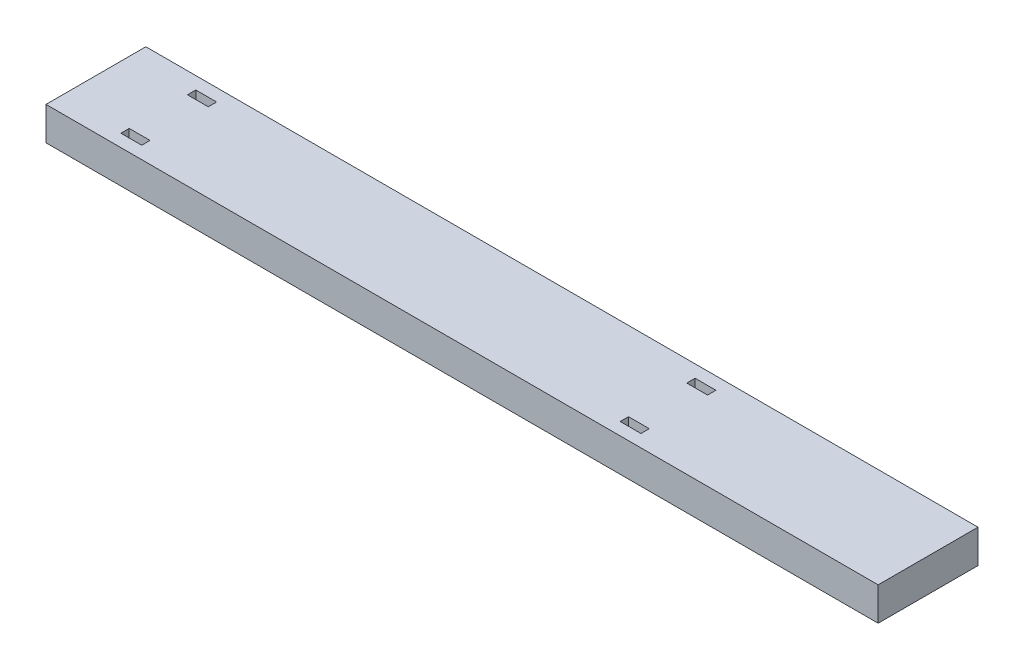
ISO-10303-21;
HEADER;
FILE_DESCRIPTION(('STEP AP214'),'2;1');
FILE_NAME('part.step','',(''),(''),'','','');
FILE_SCHEMA(('AUTOMOTIVE_DESIGN { 1 0 10303 214 1 1 1 1 }'));
ENDSEC;
DATA;
#1=APPLICATION_CONTEXT('core data for automotive mechanical design processes');
#2=APPLICATION_PROTOCOL_DEFINITION('international standard','automotive_design',2000,#1);
#3=PRODUCT_CONTEXT('',#1,'mechanical');
#4=PRODUCT('Part','Part','',(#3));
#5=PRODUCT_RELATED_PRODUCT_CATEGORY('part','',(#4));
#6=PRODUCT_DEFINITION_FORMATION('','',#4);
#7=PRODUCT_DEFINITION_CONTEXT('part definition',#1,'design');
#8=PRODUCT_DEFINITION('design','',#6,#7);
#9=PRODUCT_DEFINITION_SHAPE('','',#8);
#10=(LENGTH_UNIT() NAMED_UNIT(*) SI_UNIT(.MILLI.,.METRE.));
#11=(NAMED_UNIT(*) PLANE_ANGLE_UNIT() SI_UNIT($,.RADIAN.));
#12=(NAMED_UNIT(*) SI_UNIT($,.STERADIAN.) SOLID_ANGLE_UNIT());
#13=UNCERTAINTY_MEASURE_WITH_UNIT(LENGTH_MEASURE(1.E-05),#10,'distance_accuracy_value','');
#14=(GEOMETRIC_REPRESENTATION_CONTEXT(3) GLOBAL_UNCERTAINTY_ASSIGNED_CONTEXT((#13)) GLOBAL_UNIT_ASSIGNED_CONTEXT((#10,
#11,#12)) REPRESENTATION_CONTEXT('',''));
#15=CARTESIAN_POINT('',(0.,0.,0.));
#16=DIRECTION('',(0.,0.,1.));
#17=DIRECTION('',(1.,0.,0.));
#18=AXIS2_PLACEMENT_3D('',#15,#16,#17);
#19=CARTESIAN_POINT('',(200.,8.,0.));
#20=DIRECTION('',(0.,0.,-1.));
#21=DIRECTION('',(-1.,0.,0.));
#22=AXIS2_PLACEMENT_3D('',#19,#20,#21);
#23=PLANE('',#22);
#24=DIRECTION('',(1.,0.,0.));
#25=VECTOR('',#24,1.);
#26=CARTESIAN_POINT('',(200.,0.,0.));
#27=LINE('',#26,#25);
#28=CARTESIAN_POINT('',(0.,0.,0.));
#29=VERTEX_POINT('',#28);
#30=CARTESIAN_POINT('',(200.,0.,0.));
#31=VERTEX_POINT('',#30);
#32=EDGE_CURVE('E302',#29,#31,#27,.T.);
#33=ORIENTED_EDGE('',*,*,#32,.T.);
#34=DIRECTION('',(0.,-1.,0.));
#35=VECTOR('',#34,1.);
#36=CARTESIAN_POINT('',(200.,8.,0.));
#37=LINE('',#36,#35);
#38=CARTESIAN_POINT('',(200.,8.,0.));
#39=VERTEX_POINT('',#38);
#40=EDGE_CURVE('E11',#39,#31,#37,.T.);
#41=ORIENTED_EDGE('',*,*,#40,.F.);
#42=DIRECTION('',(1.,0.,0.));
#43=VECTOR('',#42,1.);
#44=CARTESIAN_POINT('',(200.,8.,0.));
#45=LINE('',#44,#43);
#46=CARTESIAN_POINT('',(0.,8.,0.));
#47=VERTEX_POINT('',#46);
#48=EDGE_CURVE('E309',#47,#39,#45,.T.);
#49=ORIENTED_EDGE('',*,*,#48,.F.);
#50=DIRECTION('',(0.,-1.,0.));
#51=VECTOR('',#50,1.);
#52=CARTESIAN_POINT('',(0.,8.,0.));
#53=LINE('',#52,#51);
#54=EDGE_CURVE('E319',#47,#29,#53,.T.);
#55=ORIENTED_EDGE('',*,*,#54,.T.);
#56=EDGE_LOOP('',(#33,#41,#49,#55));
#57=FACE_BOUND('',#56,.T.);
#58=ADVANCED_FACE('F37',(#57),#23,.F.);
#59=CARTESIAN_POINT('',(200.,8.,-24.));
#60=DIRECTION('',(-1.,0.,0.));
#61=DIRECTION('',(0.,0.,1.));
#62=AXIS2_PLACEMENT_3D('',#59,#60,#61);
#63=PLANE('',#62);
#64=DIRECTION('',(0.,0.,-1.));
#65=VECTOR('',#64,1.);
#66=CARTESIAN_POINT('',(200.,0.,-24.));
#67=LINE('',#66,#65);
#68=CARTESIAN_POINT('',(200.,0.,-24.));
#69=VERTEX_POINT('',#68);
#70=EDGE_CURVE('E322',#31,#69,#67,.T.);
#71=ORIENTED_EDGE('',*,*,#70,.T.);
#72=DIRECTION('',(0.,-1.,0.));
#73=VECTOR('',#72,1.);
#74=CARTESIAN_POINT('',(200.,8.,-24.));
#75=LINE('',#74,#73);
#76=CARTESIAN_POINT('',(200.,8.,-24.));
#77=VERTEX_POINT('',#76);
#78=EDGE_CURVE('E44',#77,#69,#75,.T.);
#79=ORIENTED_EDGE('',*,*,#78,.F.);
#80=DIRECTION('',(0.,0.,-1.));
#81=VECTOR('',#80,1.);
#82=CARTESIAN_POINT('',(200.,8.,-24.));
#83=LINE('',#82,#81);
#84=EDGE_CURVE('E312',#39,#77,#83,.T.);
#85=ORIENTED_EDGE('',*,*,#84,.F.);
#86=ORIENTED_EDGE('',*,*,#40,.T.);
#87=EDGE_LOOP('',(#71,#79,#85,#86));
#88=FACE_BOUND('',#87,.T.);
#89=ADVANCED_FACE('F351',(#88),#63,.F.);
#90=CARTESIAN_POINT('',(0.,8.,-24.));
#91=DIRECTION('',(0.,0.,1.));
#92=DIRECTION('',(1.,0.,0.));
#93=AXIS2_PLACEMENT_3D('',#90,#91,#92);
#94=PLANE('',#93);
#95=DIRECTION('',(-1.,0.,0.));
#96=VECTOR('',#95,1.);
#97=CARTESIAN_POINT('',(0.,0.,-24.));
#98=LINE('',#97,#96);
#99=CARTESIAN_POINT('',(0.,0.,-24.));
#100=VERTEX_POINT('',#99);
#101=EDGE_CURVE('E324',#69,#100,#98,.T.);
#102=ORIENTED_EDGE('',*,*,#101,.T.);
#103=DIRECTION('',(0.,-1.,0.));
#104=VECTOR('',#103,1.);
#105=CARTESIAN_POINT('',(0.,8.,-24.));
#106=LINE('',#105,#104);
#107=CARTESIAN_POINT('',(0.,8.,-24.));
#108=VERTEX_POINT('',#107);
#109=EDGE_CURVE('E329',#108,#100,#106,.T.);
#110=ORIENTED_EDGE('',*,*,#109,.F.);
#111=DIRECTION('',(-1.,0.,0.));
#112=VECTOR('',#111,1.);
#113=CARTESIAN_POINT('',(0.,8.,-24.));
#114=LINE('',#113,#112);
#115=EDGE_CURVE('E315',#77,#108,#114,.T.);
#116=ORIENTED_EDGE('',*,*,#115,.F.);
#117=ORIENTED_EDGE('',*,*,#78,.T.);
#118=EDGE_LOOP('',(#102,#110,#116,#117));
#119=FACE_BOUND('',#118,.T.);
#120=ADVANCED_FACE('F336',(#119),#94,.F.);
#121=CARTESIAN_POINT('',(0.,8.,0.));
#122=DIRECTION('',(1.,0.,0.));
#123=DIRECTION('',(0.,0.,-1.));
#124=AXIS2_PLACEMENT_3D('',#121,#122,#123);
#125=PLANE('',#124);
#126=DIRECTION('',(0.,0.,1.));
#127=VECTOR('',#126,1.);
#128=CARTESIAN_POINT('',(0.,0.,0.));
#129=LINE('',#128,#127);
#130=EDGE_CURVE('E313',#100,#29,#129,.T.);
#131=ORIENTED_EDGE('',*,*,#130,.T.);
#132=ORIENTED_EDGE('',*,*,#54,.F.);
#133=DIRECTION('',(0.,0.,1.));
#134=VECTOR('',#133,1.);
#135=CARTESIAN_POINT('',(0.,8.,0.));
#136=LINE('',#135,#134);
#137=EDGE_CURVE('E317',#108,#47,#136,.T.);
#138=ORIENTED_EDGE('',*,*,#137,.F.);
#139=ORIENTED_EDGE('',*,*,#109,.T.);
#140=EDGE_LOOP('',(#131,#132,#138,#139));
#141=FACE_BOUND('',#140,.T.);
#142=ADVANCED_FACE('F344',(#141),#125,.F.);
#143=CARTESIAN_POINT('',(0.,8.,0.));
#144=DIRECTION('',(0.,-1.,0.));
#145=DIRECTION('',(0.,0.,-1.));
#146=AXIS2_PLACEMENT_3D('',#143,#144,#145);
#147=PLANE('',#146);
#148=DIRECTION('',(1.,0.,0.));
#149=VECTOR('',#148,1.);
#150=CARTESIAN_POINT('',(20.,8.,-3.));
#151=LINE('',#150,#149);
#152=CARTESIAN_POINT('',(15.,8.,-3.));
#153=VERTEX_POINT('',#152);
#154=CARTESIAN_POINT('',(20.,8.,-3.));
#155=VERTEX_POINT('',#154);
#156=EDGE_CURVE('E263',#153,#155,#151,.T.);
#157=ORIENTED_EDGE('',*,*,#156,.F.);
#158=DIRECTION('',(0.,0.,1.));
#159=VECTOR('',#158,1.);
#160=CARTESIAN_POINT('',(15.,8.,-3.));
#161=LINE('',#160,#159);
#162=CARTESIAN_POINT('',(15.,8.,-5.));
#163=VERTEX_POINT('',#162);
#164=EDGE_CURVE('E51',#163,#153,#161,.T.);
#165=ORIENTED_EDGE('',*,*,#164,.F.);
#166=DIRECTION('',(-1.,0.,0.));
#167=VECTOR('',#166,1.);
#168=CARTESIAN_POINT('',(15.,8.,-5.));
#169=LINE('',#168,#167);
#170=CARTESIAN_POINT('',(20.,8.,-5.));
#171=VERTEX_POINT('',#170);
#172=EDGE_CURVE('E252',#171,#163,#169,.T.);
#173=ORIENTED_EDGE('',*,*,#172,.F.);
#174=DIRECTION('',(0.,0.,-1.));
#175=VECTOR('',#174,1.);
#176=CARTESIAN_POINT('',(20.,8.,-5.));
#177=LINE('',#176,#175);
#178=EDGE_CURVE('E266',#155,#171,#177,.T.);
#179=ORIENTED_EDGE('',*,*,#178,.F.);
#180=EDGE_LOOP('',(#157,#165,#173,#179));
#181=FACE_BOUND('',#180,.T.);
#182=DIRECTION('',(0.,0.,1.));
#183=VECTOR('',#182,1.);
#184=CARTESIAN_POINT('',(135.,8.,-2.99999999999998));
#185=LINE('',#184,#183);
#186=CARTESIAN_POINT('',(135.,8.,-4.99999999999999));
#187=VERTEX_POINT('',#186);
#188=CARTESIAN_POINT('',(135.,8.,-2.99999999999998));
#189=VERTEX_POINT('',#188);
#190=EDGE_CURVE('E233',#187,#189,#185,.T.);
#191=ORIENTED_EDGE('',*,*,#190,.F.);
#192=DIRECTION('',(-1.,0.,0.));
#193=VECTOR('',#192,1.);
#194=CARTESIAN_POINT('',(135.,8.,-4.99999999999999));
#195=LINE('',#194,#193);
#196=CARTESIAN_POINT('',(140.,8.,-4.99999999999999));
#197=VERTEX_POINT('',#196);
#198=EDGE_CURVE('E59',#197,#187,#195,.T.);
#199=ORIENTED_EDGE('',*,*,#198,.F.);
#200=DIRECTION('',(0.,0.,-1.));
#201=VECTOR('',#200,1.);
#202=CARTESIAN_POINT('',(140.,8.,-4.99999999999999));
#203=LINE('',#202,#201);
#204=CARTESIAN_POINT('',(140.,8.,-2.99999999999998));
#205=VERTEX_POINT('',#204);
#206=EDGE_CURVE('E222',#205,#197,#203,.T.);
#207=ORIENTED_EDGE('',*,*,#206,.F.);
#208=DIRECTION('',(1.,0.,0.));
#209=VECTOR('',#208,1.);
#210=CARTESIAN_POINT('',(140.,8.,-2.99999999999998));
#211=LINE('',#210,#209);
#212=EDGE_CURVE('E237',#189,#205,#211,.T.);
#213=ORIENTED_EDGE('',*,*,#212,.F.);
#214=EDGE_LOOP('',(#191,#199,#207,#213));
#215=FACE_BOUND('',#214,.T.);
#216=DIRECTION('',(0.,0.,1.));
#217=VECTOR('',#216,1.);
#218=CARTESIAN_POINT('',(135.,8.,-21.));
#219=LINE('',#218,#217);
#220=CARTESIAN_POINT('',(135.,8.,-21.));
#221=VERTEX_POINT('',#220);
#222=CARTESIAN_POINT('',(135.,8.,-19.));
#223=VERTEX_POINT('',#222);
#224=EDGE_CURVE('E207',#221,#223,#219,.T.);
#225=ORIENTED_EDGE('',*,*,#224,.F.);
#226=DIRECTION('',(-1.,0.,0.));
#227=VECTOR('',#226,1.);
#228=CARTESIAN_POINT('',(140.,8.,-21.));
#229=LINE('',#228,#227);
#230=CARTESIAN_POINT('',(140.,8.,-21.));
#231=VERTEX_POINT('',#230);
#232=EDGE_CURVE('E180',#231,#221,#229,.T.);
#233=ORIENTED_EDGE('',*,*,#232,.F.);
#234=DIRECTION('',(0.,0.,-1.));
#235=VECTOR('',#234,1.);
#236=CARTESIAN_POINT('',(140.,8.,-19.));
#237=LINE('',#236,#235);
#238=CARTESIAN_POINT('',(140.,8.,-19.));
#239=VERTEX_POINT('',#238);
#240=EDGE_CURVE('E198',#239,#231,#237,.T.);
#241=ORIENTED_EDGE('',*,*,#240,.F.);
#242=DIRECTION('',(1.,0.,0.));
#243=VECTOR('',#242,1.);
#244=CARTESIAN_POINT('',(135.,8.,-19.));
#245=LINE('',#244,#243);
#246=EDGE_CURVE('E201',#223,#239,#245,.T.);
#247=ORIENTED_EDGE('',*,*,#246,.F.);
#248=EDGE_LOOP('',(#225,#233,#241,#247));
#249=FACE_BOUND('',#248,.T.);
#250=DIRECTION('',(0.,0.,1.));
#251=VECTOR('',#250,1.);
#252=CARTESIAN_POINT('',(15.,8.,-21.));
#253=LINE('',#252,#251);
#254=CARTESIAN_POINT('',(15.,8.,-21.));
#255=VERTEX_POINT('',#254);
#256=CARTESIAN_POINT('',(15.,8.,-19.));
#257=VERTEX_POINT('',#256);
#258=EDGE_CURVE('E292',#255,#257,#253,.T.);
#259=ORIENTED_EDGE('',*,*,#258,.F.);
#260=DIRECTION('',(-1.,0.,0.));
#261=VECTOR('',#260,1.);
#262=CARTESIAN_POINT('',(20.,8.,-21.));
#263=LINE('',#262,#261);
#264=CARTESIAN_POINT('',(20.,8.,-21.));
#265=VERTEX_POINT('',#264);
#266=EDGE_CURVE('E214',#265,#255,#263,.T.);
#267=ORIENTED_EDGE('',*,*,#266,.F.);
#268=DIRECTION('',(0.,0.,-1.));
#269=VECTOR('',#268,1.);
#270=CARTESIAN_POINT('',(20.,8.,-19.));
#271=LINE('',#270,#269);
#272=CARTESIAN_POINT('',(20.,8.,-19.));
#273=VERTEX_POINT('',#272);
#274=EDGE_CURVE('E281',#273,#265,#271,.T.);
#275=ORIENTED_EDGE('',*,*,#274,.F.);
#276=DIRECTION('',(1.,0.,0.));
#277=VECTOR('',#276,1.);
#278=CARTESIAN_POINT('',(15.,8.,-19.));
#279=LINE('',#278,#277);
#280=EDGE_CURVE('E295',#257,#273,#279,.T.);
#281=ORIENTED_EDGE('',*,*,#280,.F.);
#282=EDGE_LOOP('',(#259,#267,#275,#281));
#283=FACE_BOUND('',#282,.T.);
#284=ORIENTED_EDGE('',*,*,#48,.T.);
#285=ORIENTED_EDGE('',*,*,#84,.T.);
#286=ORIENTED_EDGE('',*,*,#115,.T.);
#287=ORIENTED_EDGE('',*,*,#137,.T.);
#288=EDGE_LOOP('',(#284,#285,#286,#287));
#289=FACE_BOUND('',#288,.T.);
#290=ADVANCED_FACE('F350',(#181,#215,#249,#283,#289),#147,.F.);
#291=CARTESIAN_POINT('',(0.,0.,0.));
#292=DIRECTION('',(0.,-1.,0.));
#293=DIRECTION('',(0.,0.,-1.));
#294=AXIS2_PLACEMENT_3D('',#291,#292,#293);
#295=PLANE('',#294);
#296=DIRECTION('',(0.,0.,1.));
#297=VECTOR('',#296,1.);
#298=CARTESIAN_POINT('',(15.,0.,-3.));
#299=LINE('',#298,#297);
#300=CARTESIAN_POINT('',(15.,0.,-5.));
#301=VERTEX_POINT('',#300);
#302=CARTESIAN_POINT('',(15.,0.,-3.));
#303=VERTEX_POINT('',#302);
#304=EDGE_CURVE('E248',#301,#303,#299,.T.);
#305=ORIENTED_EDGE('',*,*,#304,.T.);
#306=DIRECTION('',(1.,0.,0.));
#307=VECTOR('',#306,1.);
#308=CARTESIAN_POINT('',(20.,0.,-3.));
#309=LINE('',#308,#307);
#310=CARTESIAN_POINT('',(20.,0.,-3.));
#311=VERTEX_POINT('',#310);
#312=EDGE_CURVE('E251',#303,#311,#309,.T.);
#313=ORIENTED_EDGE('',*,*,#312,.T.);
#314=DIRECTION('',(0.,0.,-1.));
#315=VECTOR('',#314,1.);
#316=CARTESIAN_POINT('',(20.,0.,-5.));
#317=LINE('',#316,#315);
#318=CARTESIAN_POINT('',(20.,0.,-5.));
#319=VERTEX_POINT('',#318);
#320=EDGE_CURVE('E255',#311,#319,#317,.T.);
#321=ORIENTED_EDGE('',*,*,#320,.T.);
#322=DIRECTION('',(-1.,0.,0.));
#323=VECTOR('',#322,1.);
#324=CARTESIAN_POINT('',(15.,0.,-5.));
#325=LINE('',#324,#323);
#326=EDGE_CURVE('E258',#319,#301,#325,.T.);
#327=ORIENTED_EDGE('',*,*,#326,.T.);
#328=EDGE_LOOP('',(#305,#313,#321,#327));
#329=FACE_BOUND('',#328,.T.);
#330=DIRECTION('',(-1.,0.,0.));
#331=VECTOR('',#330,1.);
#332=CARTESIAN_POINT('',(135.,0.,-4.99999999999999));
#333=LINE('',#332,#331);
#334=CARTESIAN_POINT('',(140.,0.,-4.99999999999999));
#335=VERTEX_POINT('',#334);
#336=CARTESIAN_POINT('',(135.,0.,-4.99999999999999));
#337=VERTEX_POINT('',#336);
#338=EDGE_CURVE('E218',#335,#337,#333,.T.);
#339=ORIENTED_EDGE('',*,*,#338,.T.);
#340=DIRECTION('',(0.,0.,1.));
#341=VECTOR('',#340,1.);
#342=CARTESIAN_POINT('',(135.,0.,-2.99999999999998));
#343=LINE('',#342,#341);
#344=CARTESIAN_POINT('',(135.,0.,-2.99999999999998));
#345=VERTEX_POINT('',#344);
#346=EDGE_CURVE('E221',#337,#345,#343,.T.);
#347=ORIENTED_EDGE('',*,*,#346,.T.);
#348=DIRECTION('',(1.,0.,0.));
#349=VECTOR('',#348,1.);
#350=CARTESIAN_POINT('',(140.,0.,-2.99999999999998));
#351=LINE('',#350,#349);
#352=CARTESIAN_POINT('',(140.,0.,-2.99999999999998));
#353=VERTEX_POINT('',#352);
#354=EDGE_CURVE('E225',#345,#353,#351,.T.);
#355=ORIENTED_EDGE('',*,*,#354,.T.);
#356=DIRECTION('',(0.,0.,-1.));
#357=VECTOR('',#356,1.);
#358=CARTESIAN_POINT('',(140.,0.,-4.99999999999999));
#359=LINE('',#358,#357);
#360=EDGE_CURVE('E228',#353,#335,#359,.T.);
#361=ORIENTED_EDGE('',*,*,#360,.T.);
#362=EDGE_LOOP('',(#339,#347,#355,#361));
#363=FACE_BOUND('',#362,.T.);
#364=DIRECTION('',(-1.,0.,0.));
#365=VECTOR('',#364,1.);
#366=CARTESIAN_POINT('',(140.,0.,-21.));
#367=LINE('',#366,#365);
#368=CARTESIAN_POINT('',(140.,0.,-21.));
#369=VERTEX_POINT('',#368);
#370=CARTESIAN_POINT('',(135.,0.,-21.));
#371=VERTEX_POINT('',#370);
#372=EDGE_CURVE('E177',#369,#371,#367,.T.);
#373=ORIENTED_EDGE('',*,*,#372,.T.);
#374=DIRECTION('',(0.,0.,1.));
#375=VECTOR('',#374,1.);
#376=CARTESIAN_POINT('',(135.,0.,-21.));
#377=LINE('',#376,#375);
#378=CARTESIAN_POINT('',(135.,0.,-19.));
#379=VERTEX_POINT('',#378);
#380=EDGE_CURVE('E189',#371,#379,#377,.T.);
#381=ORIENTED_EDGE('',*,*,#380,.T.);
#382=DIRECTION('',(1.,0.,0.));
#383=VECTOR('',#382,1.);
#384=CARTESIAN_POINT('',(135.,0.,-19.));
#385=LINE('',#384,#383);
#386=CARTESIAN_POINT('',(140.,0.,-19.));
#387=VERTEX_POINT('',#386);
#388=EDGE_CURVE('E193',#379,#387,#385,.T.);
#389=ORIENTED_EDGE('',*,*,#388,.T.);
#390=DIRECTION('',(0.,0.,-1.));
#391=VECTOR('',#390,1.);
#392=CARTESIAN_POINT('',(140.,0.,-19.));
#393=LINE('',#392,#391);
#394=EDGE_CURVE('E185',#387,#369,#393,.T.);
#395=ORIENTED_EDGE('',*,*,#394,.T.);
#396=EDGE_LOOP('',(#373,#381,#389,#395));
#397=FACE_BOUND('',#396,.T.);
#398=DIRECTION('',(-1.,0.,0.));
#399=VECTOR('',#398,1.);
#400=CARTESIAN_POINT('',(20.,0.,-21.));
#401=LINE('',#400,#399);
#402=CARTESIAN_POINT('',(20.,0.,-21.));
#403=VERTEX_POINT('',#402);
#404=CARTESIAN_POINT('',(15.,0.,-21.));
#405=VERTEX_POINT('',#404);
#406=EDGE_CURVE('E277',#403,#405,#401,.T.);
#407=ORIENTED_EDGE('',*,*,#406,.T.);
#408=DIRECTION('',(0.,0.,1.));
#409=VECTOR('',#408,1.);
#410=CARTESIAN_POINT('',(15.,0.,-21.));
#411=LINE('',#410,#409);
#412=CARTESIAN_POINT('',(15.,0.,-19.));
#413=VERTEX_POINT('',#412);
#414=EDGE_CURVE('E280',#405,#413,#411,.T.);
#415=ORIENTED_EDGE('',*,*,#414,.T.);
#416=DIRECTION('',(1.,0.,0.));
#417=VECTOR('',#416,1.);
#418=CARTESIAN_POINT('',(15.,0.,-19.));
#419=LINE('',#418,#417);
#420=CARTESIAN_POINT('',(20.,0.,-19.));
#421=VERTEX_POINT('',#420);
#422=EDGE_CURVE('E284',#413,#421,#419,.T.);
#423=ORIENTED_EDGE('',*,*,#422,.T.);
#424=DIRECTION('',(0.,0.,-1.));
#425=VECTOR('',#424,1.);
#426=CARTESIAN_POINT('',(20.,0.,-19.));
#427=LINE('',#426,#425);
#428=EDGE_CURVE('E287',#421,#403,#427,.T.);
#429=ORIENTED_EDGE('',*,*,#428,.T.);
#430=EDGE_LOOP('',(#407,#415,#423,#429));
#431=FACE_BOUND('',#430,.T.);
#432=ORIENTED_EDGE('',*,*,#32,.F.);
#433=ORIENTED_EDGE('',*,*,#130,.F.);
#434=ORIENTED_EDGE('',*,*,#101,.F.);
#435=ORIENTED_EDGE('',*,*,#70,.F.);
#436=EDGE_LOOP('',(#432,#433,#434,#435));
#437=FACE_BOUND('',#436,.T.);
#438=ADVANCED_FACE('F195',(#329,#363,#397,#431,#437),#295,.T.);
#439=CARTESIAN_POINT('',(20.,0.,-21.));
#440=DIRECTION('',(0.,0.,-1.));
#441=DIRECTION('',(-1.,0.,0.));
#442=AXIS2_PLACEMENT_3D('',#439,#440,#441);
#443=PLANE('',#442);
#444=ORIENTED_EDGE('',*,*,#266,.T.);
#445=DIRECTION('',(0.,1.,0.));
#446=VECTOR('',#445,1.);
#447=CARTESIAN_POINT('',(15.,0.,-21.));
#448=LINE('',#447,#446);
#449=EDGE_CURVE('E290',#405,#255,#448,.T.);
#450=ORIENTED_EDGE('',*,*,#449,.F.);
#451=ORIENTED_EDGE('',*,*,#406,.F.);
#452=DIRECTION('',(0.,1.,0.));
#453=VECTOR('',#452,1.);
#454=CARTESIAN_POINT('',(20.,0.,-21.));
#455=LINE('',#454,#453);
#456=EDGE_CURVE('E300',#403,#265,#455,.T.);
#457=ORIENTED_EDGE('',*,*,#456,.T.);
#458=EDGE_LOOP('',(#444,#450,#451,#457));
#459=FACE_BOUND('',#458,.T.);
#460=ADVANCED_FACE('F363',(#459),#443,.F.);
#461=CARTESIAN_POINT('',(20.,0.,-19.));
#462=DIRECTION('',(1.,0.,0.));
#463=DIRECTION('',(0.,0.,-1.));
#464=AXIS2_PLACEMENT_3D('',#461,#462,#463);
#465=PLANE('',#464);
#466=ORIENTED_EDGE('',*,*,#274,.T.);
#467=ORIENTED_EDGE('',*,*,#456,.F.);
#468=ORIENTED_EDGE('',*,*,#428,.F.);
#469=DIRECTION('',(0.,1.,0.));
#470=VECTOR('',#469,1.);
#471=CARTESIAN_POINT('',(20.,0.,-19.));
#472=LINE('',#471,#470);
#473=EDGE_CURVE('E303',#421,#273,#472,.T.);
#474=ORIENTED_EDGE('',*,*,#473,.T.);
#475=EDGE_LOOP('',(#466,#467,#468,#474));
#476=FACE_BOUND('',#475,.T.);
#477=ADVANCED_FACE('F370',(#476),#465,.F.);
#478=CARTESIAN_POINT('',(15.,0.,-19.));
#479=DIRECTION('',(0.,0.,1.));
#480=DIRECTION('',(1.,0.,0.));
#481=AXIS2_PLACEMENT_3D('',#478,#479,#480);
#482=PLANE('',#481);
#483=ORIENTED_EDGE('',*,*,#280,.T.);
#484=ORIENTED_EDGE('',*,*,#473,.F.);
#485=ORIENTED_EDGE('',*,*,#422,.F.);
#486=DIRECTION('',(0.,1.,0.));
#487=VECTOR('',#486,1.);
#488=CARTESIAN_POINT('',(15.,0.,-19.));
#489=LINE('',#488,#487);
#490=EDGE_CURVE('E305',#413,#257,#489,.T.);
#491=ORIENTED_EDGE('',*,*,#490,.T.);
#492=EDGE_LOOP('',(#483,#484,#485,#491));
#493=FACE_BOUND('',#492,.T.);
#494=ADVANCED_FACE('F375',(#493),#482,.F.);
#495=CARTESIAN_POINT('',(15.,0.,-21.));
#496=DIRECTION('',(-1.,0.,0.));
#497=DIRECTION('',(0.,0.,1.));
#498=AXIS2_PLACEMENT_3D('',#495,#496,#497);
#499=PLANE('',#498);
#500=ORIENTED_EDGE('',*,*,#258,.T.);
#501=ORIENTED_EDGE('',*,*,#490,.F.);
#502=ORIENTED_EDGE('',*,*,#414,.F.);
#503=ORIENTED_EDGE('',*,*,#449,.T.);
#504=EDGE_LOOP('',(#500,#501,#502,#503));
#505=FACE_BOUND('',#504,.T.);
#506=ADVANCED_FACE('F372',(#505),#499,.F.);
#507=CARTESIAN_POINT('',(140.,0.,-21.));
#508=DIRECTION('',(0.,0.,-1.));
#509=DIRECTION('',(-1.,0.,0.));
#510=AXIS2_PLACEMENT_3D('',#507,#508,#509);
#511=PLANE('',#510);
#512=ORIENTED_EDGE('',*,*,#232,.T.);
#513=DIRECTION('',(0.,1.,0.));
#514=VECTOR('',#513,1.);
#515=CARTESIAN_POINT('',(135.,0.,-21.));
#516=LINE('',#515,#514);
#517=EDGE_CURVE('E173',#371,#221,#516,.T.);
#518=ORIENTED_EDGE('',*,*,#517,.F.);
#519=ORIENTED_EDGE('',*,*,#372,.F.);
#520=DIRECTION('',(0.,1.,0.));
#521=VECTOR('',#520,1.);
#522=CARTESIAN_POINT('',(140.,0.,-21.));
#523=LINE('',#522,#521);
#524=EDGE_CURVE('E212',#369,#231,#523,.T.);
#525=ORIENTED_EDGE('',*,*,#524,.T.);
#526=EDGE_LOOP('',(#512,#518,#519,#525));
#527=FACE_BOUND('',#526,.T.);
#528=ADVANCED_FACE('F175',(#527),#511,.F.);
#529=CARTESIAN_POINT('',(140.,0.,-19.));
#530=DIRECTION('',(1.,0.,0.));
#531=DIRECTION('',(0.,0.,-1.));
#532=AXIS2_PLACEMENT_3D('',#529,#530,#531);
#533=PLANE('',#532);
#534=ORIENTED_EDGE('',*,*,#240,.T.);
#535=ORIENTED_EDGE('',*,*,#524,.F.);
#536=ORIENTED_EDGE('',*,*,#394,.F.);
#537=DIRECTION('',(0.,1.,0.));
#538=VECTOR('',#537,1.);
#539=CARTESIAN_POINT('',(140.,0.,-19.));
#540=LINE('',#539,#538);
#541=EDGE_CURVE('E215',#387,#239,#540,.T.);
#542=ORIENTED_EDGE('',*,*,#541,.T.);
#543=EDGE_LOOP('',(#534,#535,#536,#542));
#544=FACE_BOUND('',#543,.T.);
#545=ADVANCED_FACE('F415',(#544),#533,.F.);
#546=CARTESIAN_POINT('',(135.,0.,-19.));
#547=DIRECTION('',(0.,0.,1.));
#548=DIRECTION('',(1.,0.,0.));
#549=AXIS2_PLACEMENT_3D('',#546,#547,#548);
#550=PLANE('',#549);
#551=ORIENTED_EDGE('',*,*,#246,.T.);
#552=ORIENTED_EDGE('',*,*,#541,.F.);
#553=ORIENTED_EDGE('',*,*,#388,.F.);
#554=DIRECTION('',(0.,1.,0.));
#555=VECTOR('',#554,1.);
#556=CARTESIAN_POINT('',(135.,0.,-19.));
#557=LINE('',#556,#555);
#558=EDGE_CURVE('E184',#379,#223,#557,.T.);
#559=ORIENTED_EDGE('',*,*,#558,.T.);
#560=EDGE_LOOP('',(#551,#552,#553,#559));
#561=FACE_BOUND('',#560,.T.);
#562=ADVANCED_FACE('F418',(#561),#550,.F.);
#563=CARTESIAN_POINT('',(135.,0.,-21.));
#564=DIRECTION('',(-1.,0.,0.));
#565=DIRECTION('',(0.,0.,1.));
#566=AXIS2_PLACEMENT_3D('',#563,#564,#565);
#567=PLANE('',#566);
#568=ORIENTED_EDGE('',*,*,#224,.T.);
#569=ORIENTED_EDGE('',*,*,#558,.F.);
#570=ORIENTED_EDGE('',*,*,#380,.F.);
#571=ORIENTED_EDGE('',*,*,#517,.T.);
#572=EDGE_LOOP('',(#568,#569,#570,#571));
#573=FACE_BOUND('',#572,.T.);
#574=ADVANCED_FACE('F190',(#573),#567,.F.);
#575=CARTESIAN_POINT('',(135.,0.,-4.99999999999999));
#576=DIRECTION('',(0.,0.,-1.));
#577=DIRECTION('',(-1.,0.,0.));
#578=AXIS2_PLACEMENT_3D('',#575,#576,#577);
#579=PLANE('',#578);
#580=ORIENTED_EDGE('',*,*,#198,.T.);
#581=DIRECTION('',(0.,1.,0.));
#582=VECTOR('',#581,1.);
#583=CARTESIAN_POINT('',(135.,0.,-4.99999999999999));
#584=LINE('',#583,#582);
#585=EDGE_CURVE('E231',#337,#187,#584,.T.);
#586=ORIENTED_EDGE('',*,*,#585,.F.);
#587=ORIENTED_EDGE('',*,*,#338,.F.);
#588=DIRECTION('',(0.,1.,0.));
#589=VECTOR('',#588,1.);
#590=CARTESIAN_POINT('',(140.,0.,-4.99999999999999));
#591=LINE('',#590,#589);
#592=EDGE_CURVE('E208',#335,#197,#591,.T.);
#593=ORIENTED_EDGE('',*,*,#592,.T.);
#594=EDGE_LOOP('',(#580,#586,#587,#593));
#595=FACE_BOUND('',#594,.T.);
#596=ADVANCED_FACE('F399',(#595),#579,.F.);
#597=CARTESIAN_POINT('',(140.,0.,-4.99999999999999));
#598=DIRECTION('',(1.,0.,0.));
#599=DIRECTION('',(0.,0.,-1.));
#600=AXIS2_PLACEMENT_3D('',#597,#598,#599);
#601=PLANE('',#600);
#602=ORIENTED_EDGE('',*,*,#206,.T.);
#603=ORIENTED_EDGE('',*,*,#592,.F.);
#604=ORIENTED_EDGE('',*,*,#360,.F.);
#605=DIRECTION('',(0.,1.,0.));
#606=VECTOR('',#605,1.);
#607=CARTESIAN_POINT('',(140.,0.,-2.99999999999998));
#608=LINE('',#607,#606);
#609=EDGE_CURVE('E243',#353,#205,#608,.T.);
#610=ORIENTED_EDGE('',*,*,#609,.T.);
#611=EDGE_LOOP('',(#602,#603,#604,#610));
#612=FACE_BOUND('',#611,.T.);
#613=ADVANCED_FACE('F402',(#612),#601,.F.);
#614=CARTESIAN_POINT('',(140.,0.,-2.99999999999998));
#615=DIRECTION('',(0.,0.,1.));
#616=DIRECTION('',(1.,0.,0.));
#617=AXIS2_PLACEMENT_3D('',#614,#615,#616);
#618=PLANE('',#617);
#619=ORIENTED_EDGE('',*,*,#212,.T.);
#620=ORIENTED_EDGE('',*,*,#609,.F.);
#621=ORIENTED_EDGE('',*,*,#354,.F.);
#622=DIRECTION('',(0.,1.,0.));
#623=VECTOR('',#622,1.);
#624=CARTESIAN_POINT('',(135.,0.,-2.99999999999998));
#625=LINE('',#624,#623);
#626=EDGE_CURVE('E245',#345,#189,#625,.T.);
#627=ORIENTED_EDGE('',*,*,#626,.T.);
#628=EDGE_LOOP('',(#619,#620,#621,#627));
#629=FACE_BOUND('',#628,.T.);
#630=ADVANCED_FACE('F405',(#629),#618,.F.);
#631=CARTESIAN_POINT('',(135.,0.,-2.99999999999998));
#632=DIRECTION('',(-1.,0.,0.));
#633=DIRECTION('',(0.,0.,1.));
#634=AXIS2_PLACEMENT_3D('',#631,#632,#633);
#635=PLANE('',#634);
#636=ORIENTED_EDGE('',*,*,#190,.T.);
#637=ORIENTED_EDGE('',*,*,#626,.F.);
#638=ORIENTED_EDGE('',*,*,#346,.F.);
#639=ORIENTED_EDGE('',*,*,#585,.T.);
#640=EDGE_LOOP('',(#636,#637,#638,#639));
#641=FACE_BOUND('',#640,.T.);
#642=ADVANCED_FACE('F387',(#641),#635,.F.);
#643=CARTESIAN_POINT('',(15.,0.,-3.));
#644=DIRECTION('',(-1.,0.,0.));
#645=DIRECTION('',(0.,0.,1.));
#646=AXIS2_PLACEMENT_3D('',#643,#644,#645);
#647=PLANE('',#646);
#648=ORIENTED_EDGE('',*,*,#164,.T.);
#649=DIRECTION('',(0.,1.,0.));
#650=VECTOR('',#649,1.);
#651=CARTESIAN_POINT('',(15.,0.,-3.));
#652=LINE('',#651,#650);
#653=EDGE_CURVE('E261',#303,#153,#652,.T.);
#654=ORIENTED_EDGE('',*,*,#653,.F.);
#655=ORIENTED_EDGE('',*,*,#304,.F.);
#656=DIRECTION('',(0.,1.,0.));
#657=VECTOR('',#656,1.);
#658=CARTESIAN_POINT('',(15.,0.,-5.));
#659=LINE('',#658,#657);
#660=EDGE_CURVE('E234',#301,#163,#659,.T.);
#661=ORIENTED_EDGE('',*,*,#660,.T.);
#662=EDGE_LOOP('',(#648,#654,#655,#661));
#663=FACE_BOUND('',#662,.T.);
#664=ADVANCED_FACE('F383',(#663),#647,.F.);
#665=CARTESIAN_POINT('',(15.,0.,-5.));
#666=DIRECTION('',(0.,0.,-1.));
#667=DIRECTION('',(-1.,0.,0.));
#668=AXIS2_PLACEMENT_3D('',#665,#666,#667);
#669=PLANE('',#668);
#670=ORIENTED_EDGE('',*,*,#172,.T.);
#671=ORIENTED_EDGE('',*,*,#660,.F.);
#672=ORIENTED_EDGE('',*,*,#326,.F.);
#673=DIRECTION('',(0.,1.,0.));
#674=VECTOR('',#673,1.);
#675=CARTESIAN_POINT('',(20.,0.,-5.));
#676=LINE('',#675,#674);
#677=EDGE_CURVE('E272',#319,#171,#676,.T.);
#678=ORIENTED_EDGE('',*,*,#677,.T.);
#679=EDGE_LOOP('',(#670,#671,#672,#678));
#680=FACE_BOUND('',#679,.T.);
#681=ADVANCED_FACE('F386',(#680),#669,.F.);
#682=CARTESIAN_POINT('',(20.,0.,-5.));
#683=DIRECTION('',(1.,0.,0.));
#684=DIRECTION('',(0.,0.,-1.));
#685=AXIS2_PLACEMENT_3D('',#682,#683,#684);
#686=PLANE('',#685);
#687=ORIENTED_EDGE('',*,*,#178,.T.);
#688=ORIENTED_EDGE('',*,*,#677,.F.);
#689=ORIENTED_EDGE('',*,*,#320,.F.);
#690=DIRECTION('',(0.,1.,0.));
#691=VECTOR('',#690,1.);
#692=CARTESIAN_POINT('',(20.,0.,-3.));
#693=LINE('',#692,#691);
#694=EDGE_CURVE('E274',#311,#155,#693,.T.);
#695=ORIENTED_EDGE('',*,*,#694,.T.);
#696=EDGE_LOOP('',(#687,#688,#689,#695));
#697=FACE_BOUND('',#696,.T.);
#698=ADVANCED_FACE('F391',(#697),#686,.F.);
#699=CARTESIAN_POINT('',(20.,0.,-3.));
#700=DIRECTION('',(0.,0.,1.));
#701=DIRECTION('',(1.,0.,0.));
#702=AXIS2_PLACEMENT_3D('',#699,#700,#701);
#703=PLANE('',#702);
#704=ORIENTED_EDGE('',*,*,#156,.T.);
#705=ORIENTED_EDGE('',*,*,#694,.F.);
#706=ORIENTED_EDGE('',*,*,#312,.F.);
#707=ORIENTED_EDGE('',*,*,#653,.T.);
#708=EDGE_LOOP('',(#704,#705,#706,#707));
#709=FACE_BOUND('',#708,.T.);
#710=ADVANCED_FACE('F388',(#709),#703,.F.);
#711=CLOSED_SHELL('',(#58,#89,#120,#142,#290,#438,#460,#477,#494,#506,#528,#545,#562,#574,#596,
#613,#630,#642,#664,#681,#698,#710));
#712=MANIFOLD_SOLID_BREP('B2',#711);
#713=ADVANCED_BREP_SHAPE_REPRESENTATION('',(#18,#712),#14);
#714=SHAPE_DEFINITION_REPRESENTATION(#9,#713);
ENDSEC;
END-ISO-10303-21;
